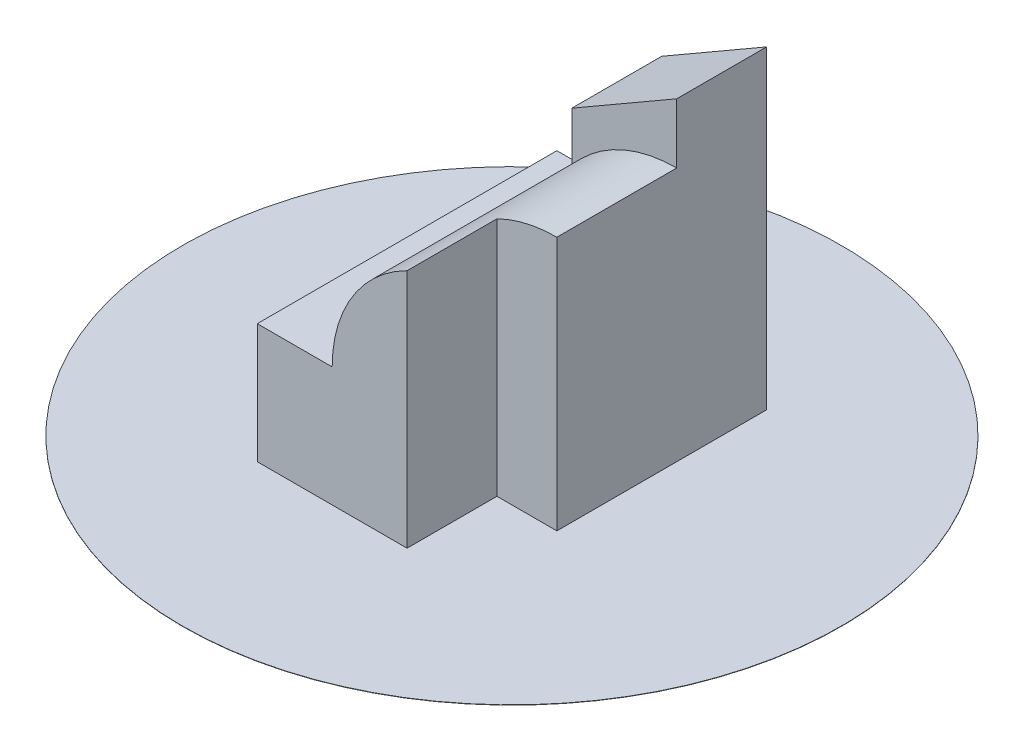
ISO-10303-21;
HEADER;
FILE_DESCRIPTION(('STEP AP214'),'2;1');
FILE_NAME('part.step','',(''),(''),'','','');
FILE_SCHEMA(('AUTOMOTIVE_DESIGN { 1 0 10303 214 1 1 1 1 }'));
ENDSEC;
DATA;
#1=APPLICATION_CONTEXT('core data for automotive mechanical design processes');
#2=APPLICATION_PROTOCOL_DEFINITION('international standard','automotive_design',2000,#1);
#3=PRODUCT_CONTEXT('',#1,'mechanical');
#4=PRODUCT('Part','Part','',(#3));
#5=PRODUCT_RELATED_PRODUCT_CATEGORY('part','',(#4));
#6=PRODUCT_DEFINITION_FORMATION('','',#4);
#7=PRODUCT_DEFINITION_CONTEXT('part definition',#1,'design');
#8=PRODUCT_DEFINITION('design','',#6,#7);
#9=PRODUCT_DEFINITION_SHAPE('','',#8);
#10=(LENGTH_UNIT() NAMED_UNIT(*) SI_UNIT(.MILLI.,.METRE.));
#11=(NAMED_UNIT(*) PLANE_ANGLE_UNIT() SI_UNIT($,.RADIAN.));
#12=(NAMED_UNIT(*) SI_UNIT($,.STERADIAN.) SOLID_ANGLE_UNIT());
#13=UNCERTAINTY_MEASURE_WITH_UNIT(LENGTH_MEASURE(1.E-05),#10,'distance_accuracy_value','');
#14=(GEOMETRIC_REPRESENTATION_CONTEXT(3) GLOBAL_UNCERTAINTY_ASSIGNED_CONTEXT((#13)) GLOBAL_UNIT_ASSIGNED_CONTEXT((#10,
#11,#12)) REPRESENTATION_CONTEXT('',''));
#15=CARTESIAN_POINT('',(0.,0.,0.));
#16=DIRECTION('',(0.,0.,1.));
#17=DIRECTION('',(1.,0.,0.));
#18=AXIS2_PLACEMENT_3D('',#15,#16,#17);
#19=CARTESIAN_POINT('',(70.,40.,-100.));
#20=DIRECTION('',(0.,0.,1.));
#21=DIRECTION('',(1.,0.,0.));
#22=AXIS2_PLACEMENT_3D('',#19,#20,#21);
#23=CYLINDRICAL_SURFACE('',#22,45.);
#24=DIRECTION('',(0.,0.,1.));
#25=VECTOR('',#24,1.);
#26=CARTESIAN_POINT('',(50.,80.3112887414928,-100.));
#27=LINE('',#26,#25);
#28=CARTESIAN_POINT('',(50.,80.3112887414928,0.));
#29=VERTEX_POINT('',#28);
#30=CARTESIAN_POINT('',(50.,80.3112887414928,-30.));
#31=VERTEX_POINT('',#30);
#32=EDGE_CURVE('E114',#29,#31,#27,.F.);
#33=ORIENTED_EDGE('',*,*,#32,.T.);
#34=CARTESIAN_POINT('',(70.,40.,-30.));
#35=DIRECTION('',(0.,0.,1.));
#36=DIRECTION('',(1.,0.,0.));
#37=AXIS2_PLACEMENT_3D('',#34,#35,#36);
#38=CIRCLE('',#37,45.);
#39=CARTESIAN_POINT('',(70.,85.,-30.));
#40=VERTEX_POINT('',#39);
#41=EDGE_CURVE('E155',#31,#40,#38,.F.);
#42=ORIENTED_EDGE('',*,*,#41,.T.);
#43=DIRECTION('',(0.,0.,1.));
#44=VECTOR('',#43,1.);
#45=CARTESIAN_POINT('',(70.,85.,-100.));
#46=LINE('',#45,#44);
#47=CARTESIAN_POINT('',(70.,85.,-70.));
#48=VERTEX_POINT('',#47);
#49=EDGE_CURVE('E184',#48,#40,#46,.T.);
#50=ORIENTED_EDGE('',*,*,#49,.F.);
#51=CARTESIAN_POINT('',(70.,40.,-70.));
#52=DIRECTION('',(0.,0.,-1.));
#53=DIRECTION('',(-1.,0.,0.));
#54=AXIS2_PLACEMENT_3D('',#51,#52,#53);
#55=CIRCLE('',#54,45.);
#56=CARTESIAN_POINT('',(35.,68.2842712474619,-70.));
#57=VERTEX_POINT('',#56);
#58=EDGE_CURVE('E171',#48,#57,#55,.F.);
#59=ORIENTED_EDGE('',*,*,#58,.T.);
#60=DIRECTION('',(0.,0.,1.));
#61=VECTOR('',#60,1.);
#62=CARTESIAN_POINT('',(35.,68.2842712474619,-100.));
#63=LINE('',#62,#61);
#64=CARTESIAN_POINT('',(35.,68.2842712474619,-100.));
#65=VERTEX_POINT('',#64);
#66=EDGE_CURVE('E168',#57,#65,#63,.F.);
#67=ORIENTED_EDGE('',*,*,#66,.T.);
#68=CARTESIAN_POINT('',(70.,40.,-100.));
#69=DIRECTION('',(0.,0.,1.));
#70=DIRECTION('',(1.,0.,0.));
#71=AXIS2_PLACEMENT_3D('',#68,#69,#70);
#72=CIRCLE('',#71,45.);
#73=CARTESIAN_POINT('',(25.,40.,-100.));
#74=VERTEX_POINT('',#73);
#75=EDGE_CURVE('E179',#65,#74,#72,.T.);
#76=ORIENTED_EDGE('',*,*,#75,.T.);
#77=DIRECTION('',(0.,0.,1.));
#78=VECTOR('',#77,1.);
#79=CARTESIAN_POINT('',(25.,40.,-100.));
#80=LINE('',#79,#78);
#81=CARTESIAN_POINT('',(25.,40.,0.));
#82=VERTEX_POINT('',#81);
#83=EDGE_CURVE('E190',#74,#82,#80,.T.);
#84=ORIENTED_EDGE('',*,*,#83,.T.);
#85=CARTESIAN_POINT('',(70.,40.,0.));
#86=DIRECTION('',(0.,0.,1.));
#87=DIRECTION('',(1.,0.,0.));
#88=AXIS2_PLACEMENT_3D('',#85,#86,#87);
#89=CIRCLE('',#88,45.);
#90=EDGE_CURVE('E186',#29,#82,#89,.T.);
#91=ORIENTED_EDGE('',*,*,#90,.F.);
#92=EDGE_LOOP('',(#33,#42,#50,#59,#67,#76,#84,#91));
#93=FACE_BOUND('',#92,.T.);
#94=ADVANCED_FACE('F30',(#93),#23,.T.);
#95=CARTESIAN_POINT('',(70.,0.,-100.));
#96=DIRECTION('',(1.,0.,0.));
#97=DIRECTION('',(0.,1.,0.));
#98=AXIS2_PLACEMENT_3D('',#95,#96,#97);
#99=PLANE('',#98);
#100=DIRECTION('',(0.,0.,1.));
#101=VECTOR('',#100,1.);
#102=CARTESIAN_POINT('',(70.,0.1,-100.));
#103=LINE('',#102,#101);
#104=CARTESIAN_POINT('',(70.,0.100000000000003,-100.));
#105=VERTEX_POINT('',#104);
#106=CARTESIAN_POINT('',(70.,0.100000000000003,-30.));
#107=VERTEX_POINT('',#106);
#108=EDGE_CURVE('E124',#105,#107,#103,.T.);
#109=ORIENTED_EDGE('',*,*,#108,.F.);
#110=DIRECTION('',(0.,1.,0.));
#111=VECTOR('',#110,1.);
#112=CARTESIAN_POINT('',(70.,0.,-100.));
#113=LINE('',#112,#111);
#114=CARTESIAN_POINT('',(70.,105.,-100.));
#115=VERTEX_POINT('',#114);
#116=EDGE_CURVE('E176',#105,#115,#113,.T.);
#117=ORIENTED_EDGE('',*,*,#116,.T.);
#118=DIRECTION('',(0.,0.,-1.));
#119=VECTOR('',#118,1.);
#120=CARTESIAN_POINT('',(70.,105.,-100.));
#121=LINE('',#120,#119);
#122=CARTESIAN_POINT('',(70.,105.,-70.));
#123=VERTEX_POINT('',#122);
#124=EDGE_CURVE('E158',#123,#115,#121,.T.);
#125=ORIENTED_EDGE('',*,*,#124,.F.);
#126=DIRECTION('',(0.,-1.,0.));
#127=VECTOR('',#126,1.);
#128=CARTESIAN_POINT('',(70.,105.,-70.));
#129=LINE('',#128,#127);
#130=EDGE_CURVE('E161',#123,#48,#129,.T.);
#131=ORIENTED_EDGE('',*,*,#130,.T.);
#132=ORIENTED_EDGE('',*,*,#49,.T.);
#133=DIRECTION('',(0.,-1.,0.));
#134=VECTOR('',#133,1.);
#135=CARTESIAN_POINT('',(70.,105.,-30.));
#136=LINE('',#135,#134);
#137=EDGE_CURVE('E152',#40,#107,#136,.T.);
#138=ORIENTED_EDGE('',*,*,#137,.T.);
#139=EDGE_LOOP('',(#109,#117,#125,#131,#132,#138));
#140=FACE_BOUND('',#139,.T.);
#141=ADVANCED_FACE('F196',(#140),#99,.T.);
#142=CARTESIAN_POINT('',(70.,40.,0.));
#143=DIRECTION('',(0.,0.,1.));
#144=DIRECTION('',(1.,0.,0.));
#145=AXIS2_PLACEMENT_3D('',#142,#143,#144);
#146=PLANE('',#145);
#147=DIRECTION('',(-1.,0.,0.));
#148=VECTOR('',#147,1.);
#149=CARTESIAN_POINT('',(70.,0.100000000000003,0.));
#150=LINE('',#149,#148);
#151=CARTESIAN_POINT('',(50.,0.100000000000003,0.));
#152=VERTEX_POINT('',#151);
#153=CARTESIAN_POINT('',(0.,0.100000000000003,0.));
#154=VERTEX_POINT('',#153);
#155=EDGE_CURVE('E119',#152,#154,#150,.T.);
#156=ORIENTED_EDGE('',*,*,#155,.F.);
#157=DIRECTION('',(0.,1.,0.));
#158=VECTOR('',#157,1.);
#159=CARTESIAN_POINT('',(50.,40.,0.));
#160=LINE('',#159,#158);
#161=EDGE_CURVE('E38',#152,#29,#160,.T.);
#162=ORIENTED_EDGE('',*,*,#161,.T.);
#163=ORIENTED_EDGE('',*,*,#90,.T.);
#164=DIRECTION('',(-1.,0.,0.));
#165=VECTOR('',#164,1.);
#166=CARTESIAN_POINT('',(25.,40.,0.));
#167=LINE('',#166,#165);
#168=CARTESIAN_POINT('',(0.,40.,0.));
#169=VERTEX_POINT('',#168);
#170=EDGE_CURVE('E177',#82,#169,#167,.T.);
#171=ORIENTED_EDGE('',*,*,#170,.T.);
#172=DIRECTION('',(0.,-1.,0.));
#173=VECTOR('',#172,1.);
#174=CARTESIAN_POINT('',(0.,40.,0.));
#175=LINE('',#174,#173);
#176=EDGE_CURVE('E122',#169,#154,#175,.T.);
#177=ORIENTED_EDGE('',*,*,#176,.T.);
#178=EDGE_LOOP('',(#156,#162,#163,#171,#177));
#179=FACE_BOUND('',#178,.T.);
#180=ADVANCED_FACE('F120',(#179),#146,.T.);
#181=CARTESIAN_POINT('',(0.,40.,-100.));
#182=DIRECTION('',(-1.,0.,0.));
#183=DIRECTION('',(0.,-1.,0.));
#184=AXIS2_PLACEMENT_3D('',#181,#182,#183);
#185=PLANE('',#184);
#186=DIRECTION('',(0.,0.,-1.));
#187=VECTOR('',#186,1.);
#188=CARTESIAN_POINT('',(0.,0.100000000000003,-100.));
#189=LINE('',#188,#187);
#190=CARTESIAN_POINT('',(0.,0.100000000000003,-100.));
#191=VERTEX_POINT('',#190);
#192=EDGE_CURVE('E45',#154,#191,#189,.T.);
#193=ORIENTED_EDGE('',*,*,#192,.F.);
#194=ORIENTED_EDGE('',*,*,#176,.F.);
#195=DIRECTION('',(0.,0.,1.));
#196=VECTOR('',#195,1.);
#197=CARTESIAN_POINT('',(0.,40.,-100.));
#198=LINE('',#197,#196);
#199=CARTESIAN_POINT('',(0.,40.,-100.));
#200=VERTEX_POINT('',#199);
#201=EDGE_CURVE('E117',#200,#169,#198,.T.);
#202=ORIENTED_EDGE('',*,*,#201,.F.);
#203=DIRECTION('',(0.,-1.,0.));
#204=VECTOR('',#203,1.);
#205=CARTESIAN_POINT('',(0.,40.,-100.));
#206=LINE('',#205,#204);
#207=EDGE_CURVE('E174',#200,#191,#206,.T.);
#208=ORIENTED_EDGE('',*,*,#207,.T.);
#209=EDGE_LOOP('',(#193,#194,#202,#208));
#210=FACE_BOUND('',#209,.T.);
#211=ADVANCED_FACE('F32',(#210),#185,.T.);
#212=CARTESIAN_POINT('',(25.,40.,-100.));
#213=DIRECTION('',(0.,1.,0.));
#214=DIRECTION('',(0.,0.,1.));
#215=AXIS2_PLACEMENT_3D('',#212,#213,#214);
#216=PLANE('',#215);
#217=ORIENTED_EDGE('',*,*,#170,.F.);
#218=ORIENTED_EDGE('',*,*,#83,.F.);
#219=DIRECTION('',(-1.,0.,0.));
#220=VECTOR('',#219,1.);
#221=CARTESIAN_POINT('',(25.,40.,-100.));
#222=LINE('',#221,#220);
#223=EDGE_CURVE('E181',#74,#200,#222,.T.);
#224=ORIENTED_EDGE('',*,*,#223,.T.);
#225=ORIENTED_EDGE('',*,*,#201,.T.);
#226=EDGE_LOOP('',(#217,#218,#224,#225));
#227=FACE_BOUND('',#226,.T.);
#228=ADVANCED_FACE('F220',(#227),#216,.T.);
#229=CARTESIAN_POINT('',(70.,40.,-100.));
#230=DIRECTION('',(0.,0.,1.));
#231=DIRECTION('',(1.,0.,0.));
#232=AXIS2_PLACEMENT_3D('',#229,#230,#231);
#233=PLANE('',#232);
#234=ORIENTED_EDGE('',*,*,#116,.F.);
#235=DIRECTION('',(-1.,0.,0.));
#236=VECTOR('',#235,1.);
#237=CARTESIAN_POINT('',(70.,0.100000000000003,-100.));
#238=LINE('',#237,#236);
#239=EDGE_CURVE('E53',#105,#191,#238,.T.);
#240=ORIENTED_EDGE('',*,*,#239,.T.);
#241=ORIENTED_EDGE('',*,*,#207,.F.);
#242=ORIENTED_EDGE('',*,*,#223,.F.);
#243=ORIENTED_EDGE('',*,*,#75,.F.);
#244=DIRECTION('',(0.,-1.,0.));
#245=VECTOR('',#244,1.);
#246=CARTESIAN_POINT('',(35.,105.,-100.));
#247=LINE('',#246,#245);
#248=CARTESIAN_POINT('',(35.,84.7927405783634,-100.));
#249=VERTEX_POINT('',#248);
#250=EDGE_CURVE('E166',#249,#65,#247,.T.);
#251=ORIENTED_EDGE('',*,*,#250,.F.);
#252=DIRECTION('',(0.866025403784442,0.499999999999995,0.));
#253=VECTOR('',#252,1.);
#254=CARTESIAN_POINT('',(35.,84.7927405783634,-100.));
#255=LINE('',#254,#253);
#256=EDGE_CURVE('E144',#249,#115,#255,.T.);
#257=ORIENTED_EDGE('',*,*,#256,.T.);
#258=EDGE_LOOP('',(#234,#240,#241,#242,#243,#251,#257));
#259=FACE_BOUND('',#258,.T.);
#260=ADVANCED_FACE('F247',(#259),#233,.F.);
#261=CARTESIAN_POINT('',(35.,105.,-100.));
#262=DIRECTION('',(1.,0.,0.));
#263=DIRECTION('',(0.,0.,-1.));
#264=AXIS2_PLACEMENT_3D('',#261,#262,#263);
#265=PLANE('',#264);
#266=DIRECTION('',(0.,-1.,0.));
#267=VECTOR('',#266,1.);
#268=CARTESIAN_POINT('',(35.,105.,-70.));
#269=LINE('',#268,#267);
#270=CARTESIAN_POINT('',(35.,84.7927405783634,-70.));
#271=VERTEX_POINT('',#270);
#272=EDGE_CURVE('E164',#271,#57,#269,.T.);
#273=ORIENTED_EDGE('',*,*,#272,.F.);
#274=DIRECTION('',(0.,0.,1.));
#275=VECTOR('',#274,1.);
#276=CARTESIAN_POINT('',(35.,84.7927405783634,-100.));
#277=LINE('',#276,#275);
#278=EDGE_CURVE('E147',#249,#271,#277,.T.);
#279=ORIENTED_EDGE('',*,*,#278,.F.);
#280=ORIENTED_EDGE('',*,*,#250,.T.);
#281=ORIENTED_EDGE('',*,*,#66,.F.);
#282=EDGE_LOOP('',(#273,#279,#280,#281));
#283=FACE_BOUND('',#282,.T.);
#284=ADVANCED_FACE('F210',(#283),#265,.F.);
#285=CARTESIAN_POINT('',(70.,105.,-70.));
#286=DIRECTION('',(0.,0.,-1.));
#287=DIRECTION('',(-1.,0.,0.));
#288=AXIS2_PLACEMENT_3D('',#285,#286,#287);
#289=PLANE('',#288);
#290=ORIENTED_EDGE('',*,*,#130,.F.);
#291=DIRECTION('',(0.866025403784442,0.499999999999995,0.));
#292=VECTOR('',#291,1.);
#293=CARTESIAN_POINT('',(35.,84.7927405783634,-70.));
#294=LINE('',#293,#292);
#295=EDGE_CURVE('E143',#271,#123,#294,.T.);
#296=ORIENTED_EDGE('',*,*,#295,.F.);
#297=ORIENTED_EDGE('',*,*,#272,.T.);
#298=ORIENTED_EDGE('',*,*,#58,.F.);
#299=EDGE_LOOP('',(#290,#296,#297,#298));
#300=FACE_BOUND('',#299,.T.);
#301=ADVANCED_FACE('F202',(#300),#289,.F.);
#302=CARTESIAN_POINT('',(70.,105.,-30.));
#303=DIRECTION('',(0.,0.,1.));
#304=DIRECTION('',(1.,0.,0.));
#305=AXIS2_PLACEMENT_3D('',#302,#303,#304);
#306=PLANE('',#305);
#307=DIRECTION('',(-1.,0.,0.));
#308=VECTOR('',#307,1.);
#309=CARTESIAN_POINT('',(70.,0.100000000000003,-30.));
#310=LINE('',#309,#308);
#311=CARTESIAN_POINT('',(50.,0.100000000000003,-30.));
#312=VERTEX_POINT('',#311);
#313=EDGE_CURVE('E125',#107,#312,#310,.T.);
#314=ORIENTED_EDGE('',*,*,#313,.F.);
#315=ORIENTED_EDGE('',*,*,#137,.F.);
#316=ORIENTED_EDGE('',*,*,#41,.F.);
#317=DIRECTION('',(0.,-1.,0.));
#318=VECTOR('',#317,1.);
#319=CARTESIAN_POINT('',(50.,105.,-30.));
#320=LINE('',#319,#318);
#321=EDGE_CURVE('E150',#31,#312,#320,.T.);
#322=ORIENTED_EDGE('',*,*,#321,.T.);
#323=EDGE_LOOP('',(#314,#315,#316,#322));
#324=FACE_BOUND('',#323,.T.);
#325=ADVANCED_FACE('F200',(#324),#306,.T.);
#326=CARTESIAN_POINT('',(50.,105.,0.));
#327=DIRECTION('',(1.,0.,0.));
#328=DIRECTION('',(0.,0.,-1.));
#329=AXIS2_PLACEMENT_3D('',#326,#327,#328);
#330=PLANE('',#329);
#331=DIRECTION('',(0.,0.,1.));
#332=VECTOR('',#331,1.);
#333=CARTESIAN_POINT('',(50.,0.100000000000003,0.));
#334=LINE('',#333,#332);
#335=EDGE_CURVE('E11',#312,#152,#334,.T.);
#336=ORIENTED_EDGE('',*,*,#335,.F.);
#337=ORIENTED_EDGE('',*,*,#321,.F.);
#338=ORIENTED_EDGE('',*,*,#32,.F.);
#339=ORIENTED_EDGE('',*,*,#161,.F.);
#340=EDGE_LOOP('',(#336,#337,#338,#339));
#341=FACE_BOUND('',#340,.T.);
#342=ADVANCED_FACE('F110',(#341),#330,.T.);
#343=CARTESIAN_POINT('',(35.,84.7927405783634,-100.));
#344=DIRECTION('',(0.499999999999995,-0.866025403784441,0.));
#345=DIRECTION('',(0.866025403784442,0.499999999999995,0.));
#346=AXIS2_PLACEMENT_3D('',#343,#344,#345);
#347=PLANE('',#346);
#348=ORIENTED_EDGE('',*,*,#295,.T.);
#349=ORIENTED_EDGE('',*,*,#124,.T.);
#350=ORIENTED_EDGE('',*,*,#256,.F.);
#351=ORIENTED_EDGE('',*,*,#278,.T.);
#352=EDGE_LOOP('',(#348,#349,#350,#351));
#353=FACE_BOUND('',#352,.T.);
#354=ADVANCED_FACE('F208',(#353),#347,.F.);
#355=CARTESIAN_POINT('',(35.,0.1,-50.));
#356=DIRECTION('',(0.,-1.,0.));
#357=DIRECTION('',(0.,0.,-1.));
#358=AXIS2_PLACEMENT_3D('',#355,#356,#357);
#359=CYLINDRICAL_SURFACE('',#358,110.);
#360=CARTESIAN_POINT('',(35.,0.1,-50.));
#361=DIRECTION('',(0.,1.,0.));
#362=DIRECTION('',(0.,0.,1.));
#363=AXIS2_PLACEMENT_3D('',#360,#361,#362);
#364=CIRCLE('',#363,110.);
#365=CARTESIAN_POINT('',(35.,0.1,60.));
#366=VERTEX_POINT('',#365);
#367=EDGE_CURVE('E133',#366,#366,#364,.T.);
#368=ORIENTED_EDGE('',*,*,#367,.F.);
#369=EDGE_LOOP('',(#368));
#370=FACE_BOUND('',#369,.T.);
#371=CARTESIAN_POINT('',(35.,0.,-50.));
#372=DIRECTION('',(0.,1.,0.));
#373=DIRECTION('',(0.,0.,1.));
#374=AXIS2_PLACEMENT_3D('',#371,#372,#373);
#375=CIRCLE('',#374,110.);
#376=CARTESIAN_POINT('',(35.,0.,60.));
#377=VERTEX_POINT('',#376);
#378=EDGE_CURVE('E136',#377,#377,#375,.T.);
#379=ORIENTED_EDGE('',*,*,#378,.T.);
#380=EDGE_LOOP('',(#379));
#381=FACE_BOUND('',#380,.T.);
#382=ADVANCED_FACE('F228',(#370,#381),#359,.T.);
#383=CARTESIAN_POINT('',(35.,0.1,-50.));
#384=DIRECTION('',(0.,1.,0.));
#385=DIRECTION('',(0.,0.,1.));
#386=AXIS2_PLACEMENT_3D('',#383,#384,#385);
#387=PLANE('',#386);
#388=ORIENTED_EDGE('',*,*,#155,.T.);
#389=ORIENTED_EDGE('',*,*,#192,.T.);
#390=ORIENTED_EDGE('',*,*,#239,.F.);
#391=ORIENTED_EDGE('',*,*,#108,.T.);
#392=ORIENTED_EDGE('',*,*,#313,.T.);
#393=ORIENTED_EDGE('',*,*,#335,.T.);
#394=EDGE_LOOP('',(#388,#389,#390,#391,#392,#393));
#395=FACE_BOUND('',#394,.T.);
#396=ORIENTED_EDGE('',*,*,#367,.T.);
#397=EDGE_LOOP('',(#396));
#398=FACE_BOUND('',#397,.T.);
#399=ADVANCED_FACE('F128',(#395,#398),#387,.T.);
#400=CARTESIAN_POINT('',(0.,0.,-100.));
#401=DIRECTION('',(0.,-1.,0.));
#402=DIRECTION('',(0.,0.,-1.));
#403=AXIS2_PLACEMENT_3D('',#400,#401,#402);
#404=PLANE('',#403);
#405=ORIENTED_EDGE('',*,*,#378,.F.);
#406=EDGE_LOOP('',(#405));
#407=FACE_BOUND('',#406,.T.);
#408=ADVANCED_FACE('F222',(#407),#404,.T.);
#409=CLOSED_SHELL('',(#94,#141,#180,#211,#228,#260,#284,#301,#325,#342,#354,#382,#399,#408));
#410=MANIFOLD_SOLID_BREP('B2',#409);
#411=ADVANCED_BREP_SHAPE_REPRESENTATION('',(#18,#410),#14);
#412=SHAPE_DEFINITION_REPRESENTATION(#9,#411);
ENDSEC;
END-ISO-10303-21;
